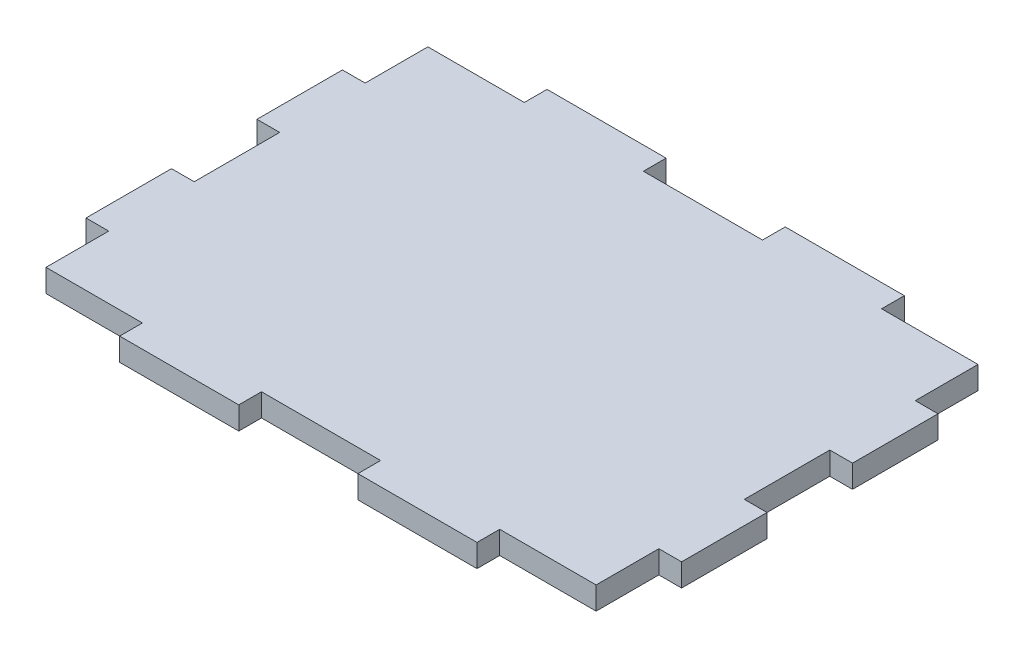
ISO-10303-21;
HEADER;
FILE_DESCRIPTION(('STEP AP214'),'2;1');
FILE_NAME('part.step','',(''),(''),'','','');
FILE_SCHEMA(('AUTOMOTIVE_DESIGN { 1 0 10303 214 1 1 1 1 }'));
ENDSEC;
DATA;
#1=APPLICATION_CONTEXT('core data for automotive mechanical design processes');
#2=APPLICATION_PROTOCOL_DEFINITION('international standard','automotive_design',2000,#1);
#3=PRODUCT_CONTEXT('',#1,'mechanical');
#4=PRODUCT('Part','Part','',(#3));
#5=PRODUCT_RELATED_PRODUCT_CATEGORY('part','',(#4));
#6=PRODUCT_DEFINITION_FORMATION('','',#4);
#7=PRODUCT_DEFINITION_CONTEXT('part definition',#1,'design');
#8=PRODUCT_DEFINITION('design','',#6,#7);
#9=PRODUCT_DEFINITION_SHAPE('','',#8);
#10=(LENGTH_UNIT() NAMED_UNIT(*) SI_UNIT(.MILLI.,.METRE.));
#11=(NAMED_UNIT(*) PLANE_ANGLE_UNIT() SI_UNIT($,.RADIAN.));
#12=(NAMED_UNIT(*) SI_UNIT($,.STERADIAN.) SOLID_ANGLE_UNIT());
#13=UNCERTAINTY_MEASURE_WITH_UNIT(LENGTH_MEASURE(1.E-05),#10,'distance_accuracy_value','');
#14=(GEOMETRIC_REPRESENTATION_CONTEXT(3) GLOBAL_UNCERTAINTY_ASSIGNED_CONTEXT((#13)) GLOBAL_UNIT_ASSIGNED_CONTEXT((#10,
#11,#12)) REPRESENTATION_CONTEXT('',''));
#15=CARTESIAN_POINT('',(0.,0.,0.));
#16=DIRECTION('',(0.,0.,1.));
#17=DIRECTION('',(1.,0.,0.));
#18=AXIS2_PLACEMENT_3D('',#15,#16,#17);
#19=CARTESIAN_POINT('',(41.5925,3.175,29.845));
#20=DIRECTION('',(-1.,0.,0.));
#21=DIRECTION('',(0.,0.,1.));
#22=AXIS2_PLACEMENT_3D('',#19,#20,#21);
#23=PLANE('',#22);
#24=DIRECTION('',(0.,0.,-1.));
#25=VECTOR('',#24,1.);
#26=CARTESIAN_POINT('',(41.5925,3.175,29.845));
#27=LINE('',#26,#25);
#28=CARTESIAN_POINT('',(41.5925,3.175,17.907));
#29=VERTEX_POINT('',#28);
#30=CARTESIAN_POINT('',(41.5925,3.175,5.96899999999999));
#31=VERTEX_POINT('',#30);
#32=EDGE_CURVE('E506',#29,#31,#27,.T.);
#33=ORIENTED_EDGE('',*,*,#32,.F.);
#34=DIRECTION('',(0.,1.,0.));
#35=VECTOR('',#34,1.);
#36=CARTESIAN_POINT('',(41.5925,0.,17.907));
#37=LINE('',#36,#35);
#38=CARTESIAN_POINT('',(41.5925,0.,17.907));
#39=VERTEX_POINT('',#38);
#40=EDGE_CURVE('E330',#39,#29,#37,.T.);
#41=ORIENTED_EDGE('',*,*,#40,.F.);
#42=DIRECTION('',(0.,0.,-1.));
#43=VECTOR('',#42,1.);
#44=CARTESIAN_POINT('',(41.5925,0.,29.845));
#45=LINE('',#44,#43);
#46=CARTESIAN_POINT('',(41.5925,0.,5.96899999999999));
#47=VERTEX_POINT('',#46);
#48=EDGE_CURVE('E521',#39,#47,#45,.T.);
#49=ORIENTED_EDGE('',*,*,#48,.T.);
#50=DIRECTION('',(0.,1.,0.));
#51=VECTOR('',#50,1.);
#52=CARTESIAN_POINT('',(41.5925,0.,5.96899999999999));
#53=LINE('',#52,#51);
#54=EDGE_CURVE('E351',#47,#31,#53,.T.);
#55=ORIENTED_EDGE('',*,*,#54,.T.);
#56=EDGE_LOOP('',(#33,#41,#49,#55));
#57=FACE_BOUND('',#56,.T.);
#58=ADVANCED_FACE('F35',(#57),#23,.F.);
#59=CARTESIAN_POINT('',(-41.5925,3.175,29.845));
#60=DIRECTION('',(1.,0.,0.));
#61=DIRECTION('',(0.,0.,-1.));
#62=AXIS2_PLACEMENT_3D('',#59,#60,#61);
#63=PLANE('',#62);
#64=DIRECTION('',(0.,0.,1.));
#65=VECTOR('',#64,1.);
#66=CARTESIAN_POINT('',(-41.5925,0.,29.845));
#67=LINE('',#66,#65);
#68=CARTESIAN_POINT('',(-41.5925,0.,-17.907));
#69=VERTEX_POINT('',#68);
#70=CARTESIAN_POINT('',(-41.5925,0.,-5.96900000000001));
#71=VERTEX_POINT('',#70);
#72=EDGE_CURVE('E525',#69,#71,#67,.T.);
#73=ORIENTED_EDGE('',*,*,#72,.T.);
#74=DIRECTION('',(0.,1.,0.));
#75=VECTOR('',#74,1.);
#76=CARTESIAN_POINT('',(-41.5925,0.,-5.96900000000001));
#77=LINE('',#76,#75);
#78=CARTESIAN_POINT('',(-41.5925,3.175,-5.96900000000001));
#79=VERTEX_POINT('',#78);
#80=EDGE_CURVE('E314',#71,#79,#77,.T.);
#81=ORIENTED_EDGE('',*,*,#80,.T.);
#82=DIRECTION('',(0.,0.,1.));
#83=VECTOR('',#82,1.);
#84=CARTESIAN_POINT('',(-41.5925,3.175,29.845));
#85=LINE('',#84,#83);
#86=CARTESIAN_POINT('',(-41.5925,3.175,-17.907));
#87=VERTEX_POINT('',#86);
#88=EDGE_CURVE('E511',#87,#79,#85,.T.);
#89=ORIENTED_EDGE('',*,*,#88,.F.);
#90=DIRECTION('',(0.,1.,0.));
#91=VECTOR('',#90,1.);
#92=CARTESIAN_POINT('',(-41.5925,0.,-17.907));
#93=LINE('',#92,#91);
#94=EDGE_CURVE('E386',#69,#87,#93,.T.);
#95=ORIENTED_EDGE('',*,*,#94,.F.);
#96=EDGE_LOOP('',(#73,#81,#89,#95));
#97=FACE_BOUND('',#96,.T.);
#98=ADVANCED_FACE('F646',(#97),#63,.F.);
#99=CARTESIAN_POINT('',(-41.5925,3.175,-29.845));
#100=DIRECTION('',(0.,0.,1.));
#101=DIRECTION('',(1.,0.,0.));
#102=AXIS2_PLACEMENT_3D('',#99,#100,#101);
#103=PLANE('',#102);
#104=DIRECTION('',(-1.,0.,0.));
#105=VECTOR('',#104,1.);
#106=CARTESIAN_POINT('',(-41.5925,3.175,-29.845));
#107=LINE('',#106,#105);
#108=CARTESIAN_POINT('',(-8.31850000000001,3.175,-29.845));
#109=VERTEX_POINT('',#108);
#110=CARTESIAN_POINT('',(-24.9555,3.175,-29.845));
#111=VERTEX_POINT('',#110);
#112=EDGE_CURVE('E508',#109,#111,#107,.T.);
#113=ORIENTED_EDGE('',*,*,#112,.F.);
#114=DIRECTION('',(0.,1.,0.));
#115=VECTOR('',#114,1.);
#116=CARTESIAN_POINT('',(-8.31850000000001,0.,-29.845));
#117=LINE('',#116,#115);
#118=CARTESIAN_POINT('',(-8.31850000000001,0.,-29.845));
#119=VERTEX_POINT('',#118);
#120=EDGE_CURVE('E466',#119,#109,#117,.T.);
#121=ORIENTED_EDGE('',*,*,#120,.F.);
#122=DIRECTION('',(-1.,0.,0.));
#123=VECTOR('',#122,1.);
#124=CARTESIAN_POINT('',(-41.5925,0.,-29.845));
#125=LINE('',#124,#123);
#126=CARTESIAN_POINT('',(-24.9555,0.,-29.845));
#127=VERTEX_POINT('',#126);
#128=EDGE_CURVE('E522',#119,#127,#125,.T.);
#129=ORIENTED_EDGE('',*,*,#128,.T.);
#130=DIRECTION('',(0.,1.,0.));
#131=VECTOR('',#130,1.);
#132=CARTESIAN_POINT('',(-24.9555,0.,-29.845));
#133=LINE('',#132,#131);
#134=EDGE_CURVE('E487',#127,#111,#133,.T.);
#135=ORIENTED_EDGE('',*,*,#134,.T.);
#136=EDGE_LOOP('',(#113,#121,#129,#135));
#137=FACE_BOUND('',#136,.T.);
#138=ADVANCED_FACE('F624',(#137),#103,.F.);
#139=CARTESIAN_POINT('',(-41.5925,3.175,29.845));
#140=DIRECTION('',(0.,0.,-1.));
#141=DIRECTION('',(-1.,0.,0.));
#142=AXIS2_PLACEMENT_3D('',#139,#140,#141);
#143=PLANE('',#142);
#144=DIRECTION('',(1.,0.,0.));
#145=VECTOR('',#144,1.);
#146=CARTESIAN_POINT('',(-41.5925,0.,29.845));
#147=LINE('',#146,#145);
#148=CARTESIAN_POINT('',(-24.9555,0.,29.845));
#149=VERTEX_POINT('',#148);
#150=CARTESIAN_POINT('',(-8.31850000000001,0.,29.845));
#151=VERTEX_POINT('',#150);
#152=EDGE_CURVE('E507',#149,#151,#147,.T.);
#153=ORIENTED_EDGE('',*,*,#152,.T.);
#154=DIRECTION('',(0.,1.,0.));
#155=VECTOR('',#154,1.);
#156=CARTESIAN_POINT('',(-8.31850000000001,0.,29.845));
#157=LINE('',#156,#155);
#158=CARTESIAN_POINT('',(-8.31850000000001,3.175,29.845));
#159=VERTEX_POINT('',#158);
#160=EDGE_CURVE('E417',#151,#159,#157,.T.);
#161=ORIENTED_EDGE('',*,*,#160,.T.);
#162=DIRECTION('',(1.,0.,0.));
#163=VECTOR('',#162,1.);
#164=CARTESIAN_POINT('',(-41.5925,3.175,29.845));
#165=LINE('',#164,#163);
#166=CARTESIAN_POINT('',(-24.9555,3.175,29.845));
#167=VERTEX_POINT('',#166);
#168=EDGE_CURVE('E516',#167,#159,#165,.T.);
#169=ORIENTED_EDGE('',*,*,#168,.F.);
#170=DIRECTION('',(0.,1.,0.));
#171=VECTOR('',#170,1.);
#172=CARTESIAN_POINT('',(-24.9555,0.,29.845));
#173=LINE('',#172,#171);
#174=EDGE_CURVE('E497',#149,#167,#173,.T.);
#175=ORIENTED_EDGE('',*,*,#174,.F.);
#176=EDGE_LOOP('',(#153,#161,#169,#175));
#177=FACE_BOUND('',#176,.T.);
#178=ADVANCED_FACE('F667',(#177),#143,.F.);
#179=CARTESIAN_POINT('',(41.5925,3.175,-5.96900000000001));
#180=VERTEX_POINT('',#179);
#181=CARTESIAN_POINT('',(41.5925,3.175,-17.907));
#182=VERTEX_POINT('',#181);
#183=EDGE_CURVE('E504',#180,#182,#27,.T.);
#184=ORIENTED_EDGE('',*,*,#183,.F.);
#185=DIRECTION('',(0.,1.,0.));
#186=VECTOR('',#185,1.);
#187=CARTESIAN_POINT('',(41.5925,0.,-5.96900000000001));
#188=LINE('',#187,#186);
#189=CARTESIAN_POINT('',(41.5925,0.,-5.96900000000001));
#190=VERTEX_POINT('',#189);
#191=EDGE_CURVE('E344',#190,#180,#188,.T.);
#192=ORIENTED_EDGE('',*,*,#191,.F.);
#193=CARTESIAN_POINT('',(41.5925,0.,-17.907));
#194=VERTEX_POINT('',#193);
#195=EDGE_CURVE('E490',#190,#194,#45,.T.);
#196=ORIENTED_EDGE('',*,*,#195,.T.);
#197=DIRECTION('',(0.,1.,0.));
#198=VECTOR('',#197,1.);
#199=CARTESIAN_POINT('',(41.5925,0.,-17.907));
#200=LINE('',#199,#198);
#201=EDGE_CURVE('E373',#194,#182,#200,.T.);
#202=ORIENTED_EDGE('',*,*,#201,.T.);
#203=EDGE_LOOP('',(#184,#192,#196,#202));
#204=FACE_BOUND('',#203,.T.);
#205=ADVANCED_FACE('F37',(#204),#23,.F.);
#206=CARTESIAN_POINT('',(24.9555,3.175,-29.845));
#207=VERTEX_POINT('',#206);
#208=CARTESIAN_POINT('',(8.31849999999999,3.175,-29.845));
#209=VERTEX_POINT('',#208);
#210=EDGE_CURVE('E510',#207,#209,#107,.T.);
#211=ORIENTED_EDGE('',*,*,#210,.F.);
#212=DIRECTION('',(0.,1.,0.));
#213=VECTOR('',#212,1.);
#214=CARTESIAN_POINT('',(24.9555,0.,-29.845));
#215=LINE('',#214,#213);
#216=CARTESIAN_POINT('',(24.9555,0.,-29.845));
#217=VERTEX_POINT('',#216);
#218=EDGE_CURVE('E421',#217,#207,#215,.T.);
#219=ORIENTED_EDGE('',*,*,#218,.F.);
#220=CARTESIAN_POINT('',(8.31849999999999,0.,-29.845));
#221=VERTEX_POINT('',#220);
#222=EDGE_CURVE('E524',#217,#221,#125,.T.);
#223=ORIENTED_EDGE('',*,*,#222,.T.);
#224=DIRECTION('',(0.,1.,0.));
#225=VECTOR('',#224,1.);
#226=CARTESIAN_POINT('',(8.31849999999999,0.,-29.845));
#227=LINE('',#226,#225);
#228=EDGE_CURVE('E469',#221,#209,#227,.T.);
#229=ORIENTED_EDGE('',*,*,#228,.T.);
#230=EDGE_LOOP('',(#211,#219,#223,#229));
#231=FACE_BOUND('',#230,.T.);
#232=ADVANCED_FACE('F601',(#231),#103,.F.);
#233=CARTESIAN_POINT('',(-41.5925,3.175,5.96899999999999));
#234=VERTEX_POINT('',#233);
#235=CARTESIAN_POINT('',(-41.5925,3.175,17.907));
#236=VERTEX_POINT('',#235);
#237=EDGE_CURVE('E515',#234,#236,#85,.T.);
#238=ORIENTED_EDGE('',*,*,#237,.F.);
#239=DIRECTION('',(0.,1.,0.));
#240=VECTOR('',#239,1.);
#241=CARTESIAN_POINT('',(-41.5925,0.,5.96899999999999));
#242=LINE('',#241,#240);
#243=CARTESIAN_POINT('',(-41.5925,0.,5.96899999999999));
#244=VERTEX_POINT('',#243);
#245=EDGE_CURVE('E305',#244,#234,#242,.T.);
#246=ORIENTED_EDGE('',*,*,#245,.F.);
#247=CARTESIAN_POINT('',(-41.5925,0.,17.907));
#248=VERTEX_POINT('',#247);
#249=EDGE_CURVE('E529',#244,#248,#67,.T.);
#250=ORIENTED_EDGE('',*,*,#249,.T.);
#251=DIRECTION('',(0.,1.,0.));
#252=VECTOR('',#251,1.);
#253=CARTESIAN_POINT('',(-41.5925,0.,17.907));
#254=LINE('',#253,#252);
#255=EDGE_CURVE('E276',#248,#236,#254,.T.);
#256=ORIENTED_EDGE('',*,*,#255,.T.);
#257=EDGE_LOOP('',(#238,#246,#250,#256));
#258=FACE_BOUND('',#257,.T.);
#259=ADVANCED_FACE('F610',(#258),#63,.F.);
#260=CARTESIAN_POINT('',(8.31849999999999,3.175,29.845));
#261=VERTEX_POINT('',#260);
#262=CARTESIAN_POINT('',(24.9555,3.175,29.845));
#263=VERTEX_POINT('',#262);
#264=EDGE_CURVE('E514',#261,#263,#165,.T.);
#265=ORIENTED_EDGE('',*,*,#264,.F.);
#266=DIRECTION('',(0.,1.,0.));
#267=VECTOR('',#266,1.);
#268=CARTESIAN_POINT('',(8.31849999999999,0.,29.845));
#269=LINE('',#268,#267);
#270=CARTESIAN_POINT('',(8.31849999999999,0.,29.845));
#271=VERTEX_POINT('',#270);
#272=EDGE_CURVE('E431',#271,#261,#269,.T.);
#273=ORIENTED_EDGE('',*,*,#272,.F.);
#274=CARTESIAN_POINT('',(24.9555,0.,29.845));
#275=VERTEX_POINT('',#274);
#276=EDGE_CURVE('E528',#271,#275,#147,.T.);
#277=ORIENTED_EDGE('',*,*,#276,.T.);
#278=DIRECTION('',(0.,1.,0.));
#279=VECTOR('',#278,1.);
#280=CARTESIAN_POINT('',(24.9555,0.,29.845));
#281=LINE('',#280,#279);
#282=EDGE_CURVE('E398',#275,#263,#281,.T.);
#283=ORIENTED_EDGE('',*,*,#282,.T.);
#284=EDGE_LOOP('',(#265,#273,#277,#283));
#285=FACE_BOUND('',#284,.T.);
#286=ADVANCED_FACE('F557',(#285),#143,.F.);
#287=CARTESIAN_POINT('',(0.,3.175,0.));
#288=DIRECTION('',(0.,-1.,0.));
#289=DIRECTION('',(0.,0.,-1.));
#290=AXIS2_PLACEMENT_3D('',#287,#288,#289);
#291=PLANE('',#290);
#292=ORIENTED_EDGE('',*,*,#88,.T.);
#293=DIRECTION('',(-1.,0.,0.));
#294=VECTOR('',#293,1.);
#295=CARTESIAN_POINT('',(-41.5925,3.175,-5.96900000000001));
#296=LINE('',#295,#294);
#297=CARTESIAN_POINT('',(-38.4175,3.175,-5.96900000000001));
#298=VERTEX_POINT('',#297);
#299=EDGE_CURVE('E301',#298,#79,#296,.T.);
#300=ORIENTED_EDGE('',*,*,#299,.F.);
#301=DIRECTION('',(0.,0.,-1.));
#302=VECTOR('',#301,1.);
#303=CARTESIAN_POINT('',(-38.4175,3.175,-5.96900000000001));
#304=LINE('',#303,#302);
#305=CARTESIAN_POINT('',(-38.4175,3.175,5.96899999999999));
#306=VERTEX_POINT('',#305);
#307=EDGE_CURVE('E309',#306,#298,#304,.T.);
#308=ORIENTED_EDGE('',*,*,#307,.F.);
#309=DIRECTION('',(1.,0.,0.));
#310=VECTOR('',#309,1.);
#311=CARTESIAN_POINT('',(-41.5925,3.175,5.96899999999999));
#312=LINE('',#311,#310);
#313=EDGE_CURVE('E306',#234,#306,#312,.T.);
#314=ORIENTED_EDGE('',*,*,#313,.F.);
#315=ORIENTED_EDGE('',*,*,#237,.T.);
#316=DIRECTION('',(-1.,0.,0.));
#317=VECTOR('',#316,1.);
#318=CARTESIAN_POINT('',(-41.5925,3.175,17.907));
#319=LINE('',#318,#317);
#320=CARTESIAN_POINT('',(-38.4175,3.175,17.907));
#321=VERTEX_POINT('',#320);
#322=EDGE_CURVE('E291',#321,#236,#319,.T.);
#323=ORIENTED_EDGE('',*,*,#322,.F.);
#324=DIRECTION('',(0.,0.,-1.));
#325=VECTOR('',#324,1.);
#326=CARTESIAN_POINT('',(-38.4175,3.175,17.907));
#327=LINE('',#326,#325);
#328=CARTESIAN_POINT('',(-38.4175,3.175,26.67));
#329=VERTEX_POINT('',#328);
#330=EDGE_CURVE('E273',#329,#321,#327,.T.);
#331=ORIENTED_EDGE('',*,*,#330,.F.);
#332=DIRECTION('',(-1.,0.,0.));
#333=VECTOR('',#332,1.);
#334=CARTESIAN_POINT('',(-41.5925,3.175,26.67));
#335=LINE('',#334,#333);
#336=CARTESIAN_POINT('',(-24.9555,3.175,26.67));
#337=VERTEX_POINT('',#336);
#338=EDGE_CURVE('E495',#337,#329,#335,.T.);
#339=ORIENTED_EDGE('',*,*,#338,.F.);
#340=DIRECTION('',(0.,0.,-1.));
#341=VECTOR('',#340,1.);
#342=CARTESIAN_POINT('',(-24.9555,3.175,29.845));
#343=LINE('',#342,#341);
#344=EDGE_CURVE('E468',#167,#337,#343,.T.);
#345=ORIENTED_EDGE('',*,*,#344,.F.);
#346=ORIENTED_EDGE('',*,*,#168,.T.);
#347=DIRECTION('',(0.,0.,1.));
#348=VECTOR('',#347,1.);
#349=CARTESIAN_POINT('',(-8.31850000000001,3.175,29.845));
#350=LINE('',#349,#348);
#351=CARTESIAN_POINT('',(-8.31850000000001,3.175,26.67));
#352=VERTEX_POINT('',#351);
#353=EDGE_CURVE('E418',#352,#159,#350,.T.);
#354=ORIENTED_EDGE('',*,*,#353,.F.);
#355=DIRECTION('',(-1.,0.,0.));
#356=VECTOR('',#355,1.);
#357=CARTESIAN_POINT('',(-8.31850000000001,3.175,26.67));
#358=LINE('',#357,#356);
#359=CARTESIAN_POINT('',(8.31849999999999,3.175,26.67));
#360=VERTEX_POINT('',#359);
#361=EDGE_CURVE('E411',#360,#352,#358,.T.);
#362=ORIENTED_EDGE('',*,*,#361,.F.);
#363=DIRECTION('',(0.,0.,-1.));
#364=VECTOR('',#363,1.);
#365=CARTESIAN_POINT('',(8.31849999999999,3.175,29.845));
#366=LINE('',#365,#364);
#367=EDGE_CURVE('E420',#261,#360,#366,.T.);
#368=ORIENTED_EDGE('',*,*,#367,.F.);
#369=ORIENTED_EDGE('',*,*,#264,.T.);
#370=DIRECTION('',(0.,0.,1.));
#371=VECTOR('',#370,1.);
#372=CARTESIAN_POINT('',(24.9555,3.175,29.845));
#373=LINE('',#372,#371);
#374=CARTESIAN_POINT('',(24.9555,3.175,26.67));
#375=VERTEX_POINT('',#374);
#376=EDGE_CURVE('E376',#375,#263,#373,.T.);
#377=ORIENTED_EDGE('',*,*,#376,.F.);
#378=DIRECTION('',(-1.,0.,0.));
#379=VECTOR('',#378,1.);
#380=CARTESIAN_POINT('',(24.9555,3.175,26.67));
#381=LINE('',#380,#379);
#382=CARTESIAN_POINT('',(38.4175,3.175,26.67));
#383=VERTEX_POINT('',#382);
#384=EDGE_CURVE('E396',#383,#375,#381,.T.);
#385=ORIENTED_EDGE('',*,*,#384,.F.);
#386=DIRECTION('',(0.,0.,1.));
#387=VECTOR('',#386,1.);
#388=CARTESIAN_POINT('',(38.4175,3.175,17.907));
#389=LINE('',#388,#387);
#390=CARTESIAN_POINT('',(38.4175,3.175,17.907));
#391=VERTEX_POINT('',#390);
#392=EDGE_CURVE('E327',#391,#383,#389,.T.);
#393=ORIENTED_EDGE('',*,*,#392,.F.);
#394=DIRECTION('',(-1.,0.,0.));
#395=VECTOR('',#394,1.);
#396=CARTESIAN_POINT('',(41.5925,3.175,17.907));
#397=LINE('',#396,#395);
#398=EDGE_CURVE('E296',#29,#391,#397,.T.);
#399=ORIENTED_EDGE('',*,*,#398,.F.);
#400=ORIENTED_EDGE('',*,*,#32,.T.);
#401=DIRECTION('',(1.,0.,0.));
#402=VECTOR('',#401,1.);
#403=CARTESIAN_POINT('',(41.5925,3.175,5.96899999999999));
#404=LINE('',#403,#402);
#405=CARTESIAN_POINT('',(38.4175,3.175,5.96899999999999));
#406=VERTEX_POINT('',#405);
#407=EDGE_CURVE('E339',#406,#31,#404,.T.);
#408=ORIENTED_EDGE('',*,*,#407,.F.);
#409=DIRECTION('',(0.,0.,1.));
#410=VECTOR('',#409,1.);
#411=CARTESIAN_POINT('',(38.4175,3.175,-5.96900000000001));
#412=LINE('',#411,#410);
#413=CARTESIAN_POINT('',(38.4175,3.175,-5.96900000000001));
#414=VERTEX_POINT('',#413);
#415=EDGE_CURVE('E347',#414,#406,#412,.T.);
#416=ORIENTED_EDGE('',*,*,#415,.F.);
#417=DIRECTION('',(-1.,0.,0.));
#418=VECTOR('',#417,1.);
#419=CARTESIAN_POINT('',(41.5925,3.175,-5.96900000000001));
#420=LINE('',#419,#418);
#421=EDGE_CURVE('E317',#180,#414,#420,.T.);
#422=ORIENTED_EDGE('',*,*,#421,.F.);
#423=ORIENTED_EDGE('',*,*,#183,.T.);
#424=DIRECTION('',(1.,0.,0.));
#425=VECTOR('',#424,1.);
#426=CARTESIAN_POINT('',(41.5925,3.175,-17.907));
#427=LINE('',#426,#425);
#428=CARTESIAN_POINT('',(38.4175,3.175,-17.907));
#429=VERTEX_POINT('',#428);
#430=EDGE_CURVE('E364',#429,#182,#427,.T.);
#431=ORIENTED_EDGE('',*,*,#430,.F.);
#432=DIRECTION('',(0.,0.,1.));
#433=VECTOR('',#432,1.);
#434=CARTESIAN_POINT('',(38.4175,3.175,-29.845));
#435=LINE('',#434,#433);
#436=CARTESIAN_POINT('',(38.4175,3.175,-26.67));
#437=VERTEX_POINT('',#436);
#438=EDGE_CURVE('E368',#437,#429,#435,.T.);
#439=ORIENTED_EDGE('',*,*,#438,.F.);
#440=DIRECTION('',(1.,0.,0.));
#441=VECTOR('',#440,1.);
#442=CARTESIAN_POINT('',(24.9555,3.175,-26.67));
#443=LINE('',#442,#441);
#444=CARTESIAN_POINT('',(24.9555,3.175,-26.67));
#445=VERTEX_POINT('',#444);
#446=EDGE_CURVE('E439',#445,#437,#443,.T.);
#447=ORIENTED_EDGE('',*,*,#446,.F.);
#448=DIRECTION('',(0.,0.,1.));
#449=VECTOR('',#448,1.);
#450=CARTESIAN_POINT('',(24.9555,3.175,-29.845));
#451=LINE('',#450,#449);
#452=EDGE_CURVE('E404',#207,#445,#451,.T.);
#453=ORIENTED_EDGE('',*,*,#452,.F.);
#454=ORIENTED_EDGE('',*,*,#210,.T.);
#455=DIRECTION('',(0.,0.,-1.));
#456=VECTOR('',#455,1.);
#457=CARTESIAN_POINT('',(8.31849999999999,3.175,-29.845));
#458=LINE('',#457,#456);
#459=CARTESIAN_POINT('',(8.31849999999999,3.175,-26.67));
#460=VERTEX_POINT('',#459);
#461=EDGE_CURVE('E453',#460,#209,#458,.T.);
#462=ORIENTED_EDGE('',*,*,#461,.F.);
#463=DIRECTION('',(1.,0.,0.));
#464=VECTOR('',#463,1.);
#465=CARTESIAN_POINT('',(-8.31850000000001,3.175,-26.67));
#466=LINE('',#465,#464);
#467=CARTESIAN_POINT('',(-8.31850000000001,3.175,-26.67));
#468=VERTEX_POINT('',#467);
#469=EDGE_CURVE('E462',#468,#460,#466,.T.);
#470=ORIENTED_EDGE('',*,*,#469,.F.);
#471=DIRECTION('',(0.,0.,1.));
#472=VECTOR('',#471,1.);
#473=CARTESIAN_POINT('',(-8.31850000000001,3.175,-29.845));
#474=LINE('',#473,#472);
#475=EDGE_CURVE('E428',#109,#468,#474,.T.);
#476=ORIENTED_EDGE('',*,*,#475,.F.);
#477=ORIENTED_EDGE('',*,*,#112,.T.);
#478=DIRECTION('',(0.,0.,-1.));
#479=VECTOR('',#478,1.);
#480=CARTESIAN_POINT('',(-24.9555,3.175,-29.845));
#481=LINE('',#480,#479);
#482=CARTESIAN_POINT('',(-24.9555,3.175,-26.67));
#483=VERTEX_POINT('',#482);
#484=EDGE_CURVE('E478',#483,#111,#481,.T.);
#485=ORIENTED_EDGE('',*,*,#484,.F.);
#486=DIRECTION('',(1.,0.,0.));
#487=VECTOR('',#486,1.);
#488=CARTESIAN_POINT('',(-41.5925,3.175,-26.67));
#489=LINE('',#488,#487);
#490=CARTESIAN_POINT('',(-38.4175,3.175,-26.67));
#491=VERTEX_POINT('',#490);
#492=EDGE_CURVE('E482',#491,#483,#489,.T.);
#493=ORIENTED_EDGE('',*,*,#492,.F.);
#494=DIRECTION('',(0.,0.,-1.));
#495=VECTOR('',#494,1.);
#496=CARTESIAN_POINT('',(-38.4175,3.175,-29.845));
#497=LINE('',#496,#495);
#498=CARTESIAN_POINT('',(-38.4175,3.175,-17.907));
#499=VERTEX_POINT('',#498);
#500=EDGE_CURVE('E383',#499,#491,#497,.T.);
#501=ORIENTED_EDGE('',*,*,#500,.F.);
#502=DIRECTION('',(1.,0.,0.));
#503=VECTOR('',#502,1.);
#504=CARTESIAN_POINT('',(-41.5925,3.175,-17.907));
#505=LINE('',#504,#503);
#506=EDGE_CURVE('E354',#87,#499,#505,.T.);
#507=ORIENTED_EDGE('',*,*,#506,.F.);
#508=EDGE_LOOP('',(#292,#300,#308,#314,#315,#323,#331,#339,#345,#346,#354,#362,#368,#369,#377,
#385,#393,#399,#400,#408,#416,#422,#423,#431,#439,#447,#453,#454,#462,#470,#476,#477,#485,#493,
#501,#507));
#509=FACE_BOUND('',#508,.T.);
#510=ADVANCED_FACE('F547',(#509),#291,.F.);
#511=CARTESIAN_POINT('',(0.,0.,0.));
#512=DIRECTION('',(0.,-1.,0.));
#513=DIRECTION('',(0.,0.,-1.));
#514=AXIS2_PLACEMENT_3D('',#511,#512,#513);
#515=PLANE('',#514);
#516=DIRECTION('',(-1.,0.,0.));
#517=VECTOR('',#516,1.);
#518=CARTESIAN_POINT('',(-41.5925,0.,-5.96900000000001));
#519=LINE('',#518,#517);
#520=CARTESIAN_POINT('',(-38.4175,0.,-5.96900000000001));
#521=VERTEX_POINT('',#520);
#522=EDGE_CURVE('E303',#521,#71,#519,.T.);
#523=ORIENTED_EDGE('',*,*,#522,.T.);
#524=ORIENTED_EDGE('',*,*,#72,.F.);
#525=DIRECTION('',(1.,0.,0.));
#526=VECTOR('',#525,1.);
#527=CARTESIAN_POINT('',(-41.5925,0.,-17.907));
#528=LINE('',#527,#526);
#529=CARTESIAN_POINT('',(-38.4175,0.,-17.907));
#530=VERTEX_POINT('',#529);
#531=EDGE_CURVE('E379',#69,#530,#528,.T.);
#532=ORIENTED_EDGE('',*,*,#531,.T.);
#533=DIRECTION('',(0.,0.,-1.));
#534=VECTOR('',#533,1.);
#535=CARTESIAN_POINT('',(-38.4175,0.,-29.845));
#536=LINE('',#535,#534);
#537=CARTESIAN_POINT('',(-38.4175,0.,-26.67));
#538=VERTEX_POINT('',#537);
#539=EDGE_CURVE('E382',#530,#538,#536,.T.);
#540=ORIENTED_EDGE('',*,*,#539,.T.);
#541=DIRECTION('',(1.,0.,0.));
#542=VECTOR('',#541,1.);
#543=CARTESIAN_POINT('',(-41.5925,0.,-26.67));
#544=LINE('',#543,#542);
#545=CARTESIAN_POINT('',(-24.9555,0.,-26.67));
#546=VERTEX_POINT('',#545);
#547=EDGE_CURVE('E475',#538,#546,#544,.T.);
#548=ORIENTED_EDGE('',*,*,#547,.T.);
#549=DIRECTION('',(0.,0.,-1.));
#550=VECTOR('',#549,1.);
#551=CARTESIAN_POINT('',(-24.9555,0.,-29.845));
#552=LINE('',#551,#550);
#553=EDGE_CURVE('E477',#546,#127,#552,.T.);
#554=ORIENTED_EDGE('',*,*,#553,.T.);
#555=ORIENTED_EDGE('',*,*,#128,.F.);
#556=DIRECTION('',(0.,0.,1.));
#557=VECTOR('',#556,1.);
#558=CARTESIAN_POINT('',(-8.31850000000001,0.,-29.845));
#559=LINE('',#558,#557);
#560=CARTESIAN_POINT('',(-8.31850000000001,0.,-26.67));
#561=VERTEX_POINT('',#560);
#562=EDGE_CURVE('E449',#119,#561,#559,.T.);
#563=ORIENTED_EDGE('',*,*,#562,.T.);
#564=DIRECTION('',(1.,0.,0.));
#565=VECTOR('',#564,1.);
#566=CARTESIAN_POINT('',(-8.31850000000001,0.,-26.67));
#567=LINE('',#566,#565);
#568=CARTESIAN_POINT('',(8.31849999999999,0.,-26.67));
#569=VERTEX_POINT('',#568);
#570=EDGE_CURVE('E452',#561,#569,#567,.T.);
#571=ORIENTED_EDGE('',*,*,#570,.T.);
#572=DIRECTION('',(0.,0.,-1.));
#573=VECTOR('',#572,1.);
#574=CARTESIAN_POINT('',(8.31849999999999,0.,-29.845));
#575=LINE('',#574,#573);
#576=EDGE_CURVE('E456',#569,#221,#575,.T.);
#577=ORIENTED_EDGE('',*,*,#576,.T.);
#578=ORIENTED_EDGE('',*,*,#222,.F.);
#579=DIRECTION('',(0.,0.,1.));
#580=VECTOR('',#579,1.);
#581=CARTESIAN_POINT('',(24.9555,0.,-29.845));
#582=LINE('',#581,#580);
#583=CARTESIAN_POINT('',(24.9555,0.,-26.67));
#584=VERTEX_POINT('',#583);
#585=EDGE_CURVE('E435',#217,#584,#582,.T.);
#586=ORIENTED_EDGE('',*,*,#585,.T.);
#587=DIRECTION('',(1.,0.,0.));
#588=VECTOR('',#587,1.);
#589=CARTESIAN_POINT('',(24.9555,0.,-26.67));
#590=LINE('',#589,#588);
#591=CARTESIAN_POINT('',(38.4175,0.,-26.67));
#592=VERTEX_POINT('',#591);
#593=EDGE_CURVE('E438',#584,#592,#590,.T.);
#594=ORIENTED_EDGE('',*,*,#593,.T.);
#595=DIRECTION('',(0.,0.,1.));
#596=VECTOR('',#595,1.);
#597=CARTESIAN_POINT('',(38.4175,0.,-29.845));
#598=LINE('',#597,#596);
#599=CARTESIAN_POINT('',(38.4175,0.,-17.907));
#600=VERTEX_POINT('',#599);
#601=EDGE_CURVE('E360',#592,#600,#598,.T.);
#602=ORIENTED_EDGE('',*,*,#601,.T.);
#603=DIRECTION('',(1.,0.,0.));
#604=VECTOR('',#603,1.);
#605=CARTESIAN_POINT('',(41.5925,0.,-17.907));
#606=LINE('',#605,#604);
#607=EDGE_CURVE('E363',#600,#194,#606,.T.);
#608=ORIENTED_EDGE('',*,*,#607,.T.);
#609=ORIENTED_EDGE('',*,*,#195,.F.);
#610=DIRECTION('',(-1.,0.,0.));
#611=VECTOR('',#610,1.);
#612=CARTESIAN_POINT('',(41.5925,0.,-5.96900000000001));
#613=LINE('',#612,#611);
#614=CARTESIAN_POINT('',(38.4175,0.,-5.96900000000001));
#615=VERTEX_POINT('',#614);
#616=EDGE_CURVE('E336',#190,#615,#613,.T.);
#617=ORIENTED_EDGE('',*,*,#616,.T.);
#618=DIRECTION('',(0.,0.,1.));
#619=VECTOR('',#618,1.);
#620=CARTESIAN_POINT('',(38.4175,0.,-5.96900000000001));
#621=LINE('',#620,#619);
#622=CARTESIAN_POINT('',(38.4175,0.,5.96899999999999));
#623=VERTEX_POINT('',#622);
#624=EDGE_CURVE('E58',#615,#623,#621,.T.);
#625=ORIENTED_EDGE('',*,*,#624,.T.);
#626=DIRECTION('',(1.,0.,0.));
#627=VECTOR('',#626,1.);
#628=CARTESIAN_POINT('',(41.5925,0.,5.96899999999999));
#629=LINE('',#628,#627);
#630=EDGE_CURVE('E341',#623,#47,#629,.T.);
#631=ORIENTED_EDGE('',*,*,#630,.T.);
#632=ORIENTED_EDGE('',*,*,#48,.F.);
#633=DIRECTION('',(-1.,0.,0.));
#634=VECTOR('',#633,1.);
#635=CARTESIAN_POINT('',(41.5925,0.,17.907));
#636=LINE('',#635,#634);
#637=CARTESIAN_POINT('',(38.4175,0.,17.907));
#638=VERTEX_POINT('',#637);
#639=EDGE_CURVE('E323',#39,#638,#636,.T.);
#640=ORIENTED_EDGE('',*,*,#639,.T.);
#641=DIRECTION('',(0.,0.,1.));
#642=VECTOR('',#641,1.);
#643=CARTESIAN_POINT('',(38.4175,0.,17.907));
#644=LINE('',#643,#642);
#645=CARTESIAN_POINT('',(38.4175,0.,26.67));
#646=VERTEX_POINT('',#645);
#647=EDGE_CURVE('E326',#638,#646,#644,.T.);
#648=ORIENTED_EDGE('',*,*,#647,.T.);
#649=DIRECTION('',(-1.,0.,0.));
#650=VECTOR('',#649,1.);
#651=CARTESIAN_POINT('',(24.9555,0.,26.67));
#652=LINE('',#651,#650);
#653=CARTESIAN_POINT('',(24.9555,0.,26.67));
#654=VERTEX_POINT('',#653);
#655=EDGE_CURVE('E395',#646,#654,#652,.T.);
#656=ORIENTED_EDGE('',*,*,#655,.T.);
#657=DIRECTION('',(0.,0.,1.));
#658=VECTOR('',#657,1.);
#659=CARTESIAN_POINT('',(24.9555,0.,29.845));
#660=LINE('',#659,#658);
#661=EDGE_CURVE('E392',#654,#275,#660,.T.);
#662=ORIENTED_EDGE('',*,*,#661,.T.);
#663=ORIENTED_EDGE('',*,*,#276,.F.);
#664=DIRECTION('',(0.,0.,-1.));
#665=VECTOR('',#664,1.);
#666=CARTESIAN_POINT('',(8.31849999999999,0.,29.845));
#667=LINE('',#666,#665);
#668=CARTESIAN_POINT('',(8.31849999999999,0.,26.67));
#669=VERTEX_POINT('',#668);
#670=EDGE_CURVE('E410',#271,#669,#667,.T.);
#671=ORIENTED_EDGE('',*,*,#670,.T.);
#672=DIRECTION('',(-1.,0.,0.));
#673=VECTOR('',#672,1.);
#674=CARTESIAN_POINT('',(-8.31850000000001,0.,26.67));
#675=LINE('',#674,#673);
#676=CARTESIAN_POINT('',(-8.31850000000001,0.,26.67));
#677=VERTEX_POINT('',#676);
#678=EDGE_CURVE('E414',#669,#677,#675,.T.);
#679=ORIENTED_EDGE('',*,*,#678,.T.);
#680=DIRECTION('',(0.,0.,1.));
#681=VECTOR('',#680,1.);
#682=CARTESIAN_POINT('',(-8.31850000000001,0.,29.845));
#683=LINE('',#682,#681);
#684=EDGE_CURVE('E407',#677,#151,#683,.T.);
#685=ORIENTED_EDGE('',*,*,#684,.T.);
#686=ORIENTED_EDGE('',*,*,#152,.F.);
#687=DIRECTION('',(0.,0.,-1.));
#688=VECTOR('',#687,1.);
#689=CARTESIAN_POINT('',(-24.9555,0.,29.845));
#690=LINE('',#689,#688);
#691=CARTESIAN_POINT('',(-24.9555,0.,26.67));
#692=VERTEX_POINT('',#691);
#693=EDGE_CURVE('E493',#149,#692,#690,.T.);
#694=ORIENTED_EDGE('',*,*,#693,.T.);
#695=DIRECTION('',(-1.,0.,0.));
#696=VECTOR('',#695,1.);
#697=CARTESIAN_POINT('',(-41.5925,0.,26.67));
#698=LINE('',#697,#696);
#699=CARTESIAN_POINT('',(-38.4175,0.,26.67));
#700=VERTEX_POINT('',#699);
#701=EDGE_CURVE('E290',#692,#700,#698,.T.);
#702=ORIENTED_EDGE('',*,*,#701,.T.);
#703=DIRECTION('',(0.,0.,-1.));
#704=VECTOR('',#703,1.);
#705=CARTESIAN_POINT('',(-38.4175,0.,17.907));
#706=LINE('',#705,#704);
#707=CARTESIAN_POINT('',(-38.4175,0.,17.907));
#708=VERTEX_POINT('',#707);
#709=EDGE_CURVE('E271',#700,#708,#706,.T.);
#710=ORIENTED_EDGE('',*,*,#709,.T.);
#711=DIRECTION('',(-1.,0.,0.));
#712=VECTOR('',#711,1.);
#713=CARTESIAN_POINT('',(-41.5925,0.,17.907));
#714=LINE('',#713,#712);
#715=EDGE_CURVE('E277',#708,#248,#714,.T.);
#716=ORIENTED_EDGE('',*,*,#715,.T.);
#717=ORIENTED_EDGE('',*,*,#249,.F.);
#718=DIRECTION('',(1.,0.,0.));
#719=VECTOR('',#718,1.);
#720=CARTESIAN_POINT('',(-41.5925,0.,5.96899999999999));
#721=LINE('',#720,#719);
#722=CARTESIAN_POINT('',(-38.4175,0.,5.96899999999999));
#723=VERTEX_POINT('',#722);
#724=EDGE_CURVE('E298',#244,#723,#721,.T.);
#725=ORIENTED_EDGE('',*,*,#724,.T.);
#726=DIRECTION('',(0.,0.,-1.));
#727=VECTOR('',#726,1.);
#728=CARTESIAN_POINT('',(-38.4175,0.,-5.96900000000001));
#729=LINE('',#728,#727);
#730=EDGE_CURVE('E50',#723,#521,#729,.T.);
#731=ORIENTED_EDGE('',*,*,#730,.T.);
#732=EDGE_LOOP('',(#523,#524,#532,#540,#548,#554,#555,#563,#571,#577,#578,#586,#594,#602,#608,
#609,#617,#625,#631,#632,#640,#648,#656,#662,#663,#671,#679,#685,#686,#694,#702,#710,#716,#717,
#725,#731));
#733=FACE_BOUND('',#732,.T.);
#734=ADVANCED_FACE('F288',(#733),#515,.T.);
#735=CARTESIAN_POINT('',(-41.5925,0.,26.67));
#736=DIRECTION('',(0.,0.,-1.));
#737=DIRECTION('',(-1.,0.,0.));
#738=AXIS2_PLACEMENT_3D('',#735,#736,#737);
#739=PLANE('',#738);
#740=ORIENTED_EDGE('',*,*,#338,.T.);
#741=DIRECTION('',(0.,-1.,0.));
#742=VECTOR('',#741,1.);
#743=CARTESIAN_POINT('',(-38.4175,0.,26.67));
#744=LINE('',#743,#742);
#745=EDGE_CURVE('E11',#329,#700,#744,.T.);
#746=ORIENTED_EDGE('',*,*,#745,.T.);
#747=ORIENTED_EDGE('',*,*,#701,.F.);
#748=DIRECTION('',(0.,1.,0.));
#749=VECTOR('',#748,1.);
#750=CARTESIAN_POINT('',(-24.9555,0.,26.67));
#751=LINE('',#750,#749);
#752=EDGE_CURVE('E484',#692,#337,#751,.T.);
#753=ORIENTED_EDGE('',*,*,#752,.T.);
#754=EDGE_LOOP('',(#740,#746,#747,#753));
#755=FACE_BOUND('',#754,.T.);
#756=ADVANCED_FACE('F858',(#755),#739,.F.);
#757=CARTESIAN_POINT('',(-24.9555,0.,29.845));
#758=DIRECTION('',(1.,0.,0.));
#759=DIRECTION('',(0.,0.,-1.));
#760=AXIS2_PLACEMENT_3D('',#757,#758,#759);
#761=PLANE('',#760);
#762=ORIENTED_EDGE('',*,*,#344,.T.);
#763=ORIENTED_EDGE('',*,*,#752,.F.);
#764=ORIENTED_EDGE('',*,*,#693,.F.);
#765=ORIENTED_EDGE('',*,*,#174,.T.);
#766=EDGE_LOOP('',(#762,#763,#764,#765));
#767=FACE_BOUND('',#766,.T.);
#768=ADVANCED_FACE('F850',(#767),#761,.F.);
#769=CARTESIAN_POINT('',(-24.9555,0.,-29.845));
#770=DIRECTION('',(1.,0.,0.));
#771=DIRECTION('',(0.,0.,-1.));
#772=AXIS2_PLACEMENT_3D('',#769,#770,#771);
#773=PLANE('',#772);
#774=ORIENTED_EDGE('',*,*,#484,.T.);
#775=ORIENTED_EDGE('',*,*,#134,.F.);
#776=ORIENTED_EDGE('',*,*,#553,.F.);
#777=DIRECTION('',(0.,1.,0.));
#778=VECTOR('',#777,1.);
#779=CARTESIAN_POINT('',(-24.9555,0.,-26.67));
#780=LINE('',#779,#778);
#781=EDGE_CURVE('E481',#546,#483,#780,.T.);
#782=ORIENTED_EDGE('',*,*,#781,.T.);
#783=EDGE_LOOP('',(#774,#775,#776,#782));
#784=FACE_BOUND('',#783,.T.);
#785=ADVANCED_FACE('F629',(#784),#773,.F.);
#786=CARTESIAN_POINT('',(-41.5925,0.,-26.67));
#787=DIRECTION('',(0.,0.,1.));
#788=DIRECTION('',(1.,0.,0.));
#789=AXIS2_PLACEMENT_3D('',#786,#787,#788);
#790=PLANE('',#789);
#791=ORIENTED_EDGE('',*,*,#547,.F.);
#792=DIRECTION('',(0.,1.,0.));
#793=VECTOR('',#792,1.);
#794=CARTESIAN_POINT('',(-38.4175,0.,-26.67));
#795=LINE('',#794,#793);
#796=EDGE_CURVE('E534',#538,#491,#795,.T.);
#797=ORIENTED_EDGE('',*,*,#796,.T.);
#798=ORIENTED_EDGE('',*,*,#492,.T.);
#799=ORIENTED_EDGE('',*,*,#781,.F.);
#800=EDGE_LOOP('',(#791,#797,#798,#799));
#801=FACE_BOUND('',#800,.T.);
#802=ADVANCED_FACE('F634',(#801),#790,.F.);
#803=CARTESIAN_POINT('',(-8.31850000000001,0.,-29.845));
#804=DIRECTION('',(-1.,0.,0.));
#805=DIRECTION('',(0.,0.,1.));
#806=AXIS2_PLACEMENT_3D('',#803,#804,#805);
#807=PLANE('',#806);
#808=ORIENTED_EDGE('',*,*,#475,.T.);
#809=DIRECTION('',(0.,1.,0.));
#810=VECTOR('',#809,1.);
#811=CARTESIAN_POINT('',(-8.31850000000001,0.,-26.67));
#812=LINE('',#811,#810);
#813=EDGE_CURVE('E459',#561,#468,#812,.T.);
#814=ORIENTED_EDGE('',*,*,#813,.F.);
#815=ORIENTED_EDGE('',*,*,#562,.F.);
#816=ORIENTED_EDGE('',*,*,#120,.T.);
#817=EDGE_LOOP('',(#808,#814,#815,#816));
#818=FACE_BOUND('',#817,.T.);
#819=ADVANCED_FACE('F705',(#818),#807,.F.);
#820=CARTESIAN_POINT('',(8.31849999999999,0.,-29.845));
#821=DIRECTION('',(1.,0.,0.));
#822=DIRECTION('',(0.,0.,-1.));
#823=AXIS2_PLACEMENT_3D('',#820,#821,#822);
#824=PLANE('',#823);
#825=ORIENTED_EDGE('',*,*,#461,.T.);
#826=ORIENTED_EDGE('',*,*,#228,.F.);
#827=ORIENTED_EDGE('',*,*,#576,.F.);
#828=DIRECTION('',(0.,1.,0.));
#829=VECTOR('',#828,1.);
#830=CARTESIAN_POINT('',(8.31849999999999,0.,-26.67));
#831=LINE('',#830,#829);
#832=EDGE_CURVE('E472',#569,#460,#831,.T.);
#833=ORIENTED_EDGE('',*,*,#832,.T.);
#834=EDGE_LOOP('',(#825,#826,#827,#833));
#835=FACE_BOUND('',#834,.T.);
#836=ADVANCED_FACE('F614',(#835),#824,.F.);
#837=CARTESIAN_POINT('',(-8.31850000000001,0.,-26.67));
#838=DIRECTION('',(0.,0.,1.));
#839=DIRECTION('',(1.,0.,0.));
#840=AXIS2_PLACEMENT_3D('',#837,#838,#839);
#841=PLANE('',#840);
#842=ORIENTED_EDGE('',*,*,#469,.T.);
#843=ORIENTED_EDGE('',*,*,#832,.F.);
#844=ORIENTED_EDGE('',*,*,#570,.F.);
#845=ORIENTED_EDGE('',*,*,#813,.T.);
#846=EDGE_LOOP('',(#842,#843,#844,#845));
#847=FACE_BOUND('',#846,.T.);
#848=ADVANCED_FACE('F616',(#847),#841,.F.);
#849=CARTESIAN_POINT('',(24.9555,0.,29.845));
#850=DIRECTION('',(-1.,0.,0.));
#851=DIRECTION('',(0.,0.,1.));
#852=AXIS2_PLACEMENT_3D('',#849,#850,#851);
#853=PLANE('',#852);
#854=ORIENTED_EDGE('',*,*,#376,.T.);
#855=ORIENTED_EDGE('',*,*,#282,.F.);
#856=ORIENTED_EDGE('',*,*,#661,.F.);
#857=DIRECTION('',(0.,1.,0.));
#858=VECTOR('',#857,1.);
#859=CARTESIAN_POINT('',(24.9555,0.,26.67));
#860=LINE('',#859,#858);
#861=EDGE_CURVE('E401',#654,#375,#860,.T.);
#862=ORIENTED_EDGE('',*,*,#861,.T.);
#863=EDGE_LOOP('',(#854,#855,#856,#862));
#864=FACE_BOUND('',#863,.T.);
#865=ADVANCED_FACE('F553',(#864),#853,.F.);
#866=CARTESIAN_POINT('',(24.9555,0.,26.67));
#867=DIRECTION('',(0.,0.,-1.));
#868=DIRECTION('',(-1.,0.,0.));
#869=AXIS2_PLACEMENT_3D('',#866,#867,#868);
#870=PLANE('',#869);
#871=ORIENTED_EDGE('',*,*,#655,.F.);
#872=DIRECTION('',(0.,1.,0.));
#873=VECTOR('',#872,1.);
#874=CARTESIAN_POINT('',(38.4175,0.,26.67));
#875=LINE('',#874,#873);
#876=EDGE_CURVE('E43',#646,#383,#875,.T.);
#877=ORIENTED_EDGE('',*,*,#876,.T.);
#878=ORIENTED_EDGE('',*,*,#384,.T.);
#879=ORIENTED_EDGE('',*,*,#861,.F.);
#880=EDGE_LOOP('',(#871,#877,#878,#879));
#881=FACE_BOUND('',#880,.T.);
#882=ADVANCED_FACE('F540',(#881),#870,.F.);
#883=CARTESIAN_POINT('',(24.9555,0.,-29.845));
#884=DIRECTION('',(-1.,0.,0.));
#885=DIRECTION('',(0.,0.,1.));
#886=AXIS2_PLACEMENT_3D('',#883,#884,#885);
#887=PLANE('',#886);
#888=ORIENTED_EDGE('',*,*,#452,.T.);
#889=DIRECTION('',(0.,1.,0.));
#890=VECTOR('',#889,1.);
#891=CARTESIAN_POINT('',(24.9555,0.,-26.67));
#892=LINE('',#891,#890);
#893=EDGE_CURVE('E442',#584,#445,#892,.T.);
#894=ORIENTED_EDGE('',*,*,#893,.F.);
#895=ORIENTED_EDGE('',*,*,#585,.F.);
#896=ORIENTED_EDGE('',*,*,#218,.T.);
#897=EDGE_LOOP('',(#888,#894,#895,#896));
#898=FACE_BOUND('',#897,.T.);
#899=ADVANCED_FACE('F595',(#898),#887,.F.);
#900=CARTESIAN_POINT('',(24.9555,0.,-26.67));
#901=DIRECTION('',(0.,0.,1.));
#902=DIRECTION('',(1.,0.,0.));
#903=AXIS2_PLACEMENT_3D('',#900,#901,#902);
#904=PLANE('',#903);
#905=ORIENTED_EDGE('',*,*,#446,.T.);
#906=DIRECTION('',(0.,-1.,0.));
#907=VECTOR('',#906,1.);
#908=CARTESIAN_POINT('',(38.4175,0.,-26.67));
#909=LINE('',#908,#907);
#910=EDGE_CURVE('E519',#437,#592,#909,.T.);
#911=ORIENTED_EDGE('',*,*,#910,.T.);
#912=ORIENTED_EDGE('',*,*,#593,.F.);
#913=ORIENTED_EDGE('',*,*,#893,.T.);
#914=EDGE_LOOP('',(#905,#911,#912,#913));
#915=FACE_BOUND('',#914,.T.);
#916=ADVANCED_FACE('F592',(#915),#904,.F.);
#917=CARTESIAN_POINT('',(-8.31850000000001,0.,29.845));
#918=DIRECTION('',(-1.,0.,0.));
#919=DIRECTION('',(0.,0.,1.));
#920=AXIS2_PLACEMENT_3D('',#917,#918,#919);
#921=PLANE('',#920);
#922=ORIENTED_EDGE('',*,*,#353,.T.);
#923=ORIENTED_EDGE('',*,*,#160,.F.);
#924=ORIENTED_EDGE('',*,*,#684,.F.);
#925=DIRECTION('',(0.,1.,0.));
#926=VECTOR('',#925,1.);
#927=CARTESIAN_POINT('',(-8.31850000000001,0.,26.67));
#928=LINE('',#927,#926);
#929=EDGE_CURVE('E426',#677,#352,#928,.T.);
#930=ORIENTED_EDGE('',*,*,#929,.T.);
#931=EDGE_LOOP('',(#922,#923,#924,#930));
#932=FACE_BOUND('',#931,.T.);
#933=ADVANCED_FACE('F752',(#932),#921,.F.);
#934=CARTESIAN_POINT('',(-8.31850000000001,0.,26.67));
#935=DIRECTION('',(0.,0.,-1.));
#936=DIRECTION('',(-1.,0.,0.));
#937=AXIS2_PLACEMENT_3D('',#934,#935,#936);
#938=PLANE('',#937);
#939=ORIENTED_EDGE('',*,*,#361,.T.);
#940=ORIENTED_EDGE('',*,*,#929,.F.);
#941=ORIENTED_EDGE('',*,*,#678,.F.);
#942=DIRECTION('',(0.,1.,0.));
#943=VECTOR('',#942,1.);
#944=CARTESIAN_POINT('',(8.31849999999999,0.,26.67));
#945=LINE('',#944,#943);
#946=EDGE_CURVE('E429',#669,#360,#945,.T.);
#947=ORIENTED_EDGE('',*,*,#946,.T.);
#948=EDGE_LOOP('',(#939,#940,#941,#947));
#949=FACE_BOUND('',#948,.T.);
#950=ADVANCED_FACE('F757',(#949),#938,.F.);
#951=CARTESIAN_POINT('',(8.31849999999999,0.,29.845));
#952=DIRECTION('',(1.,0.,0.));
#953=DIRECTION('',(0.,0.,-1.));
#954=AXIS2_PLACEMENT_3D('',#951,#952,#953);
#955=PLANE('',#954);
#956=ORIENTED_EDGE('',*,*,#367,.T.);
#957=ORIENTED_EDGE('',*,*,#946,.F.);
#958=ORIENTED_EDGE('',*,*,#670,.F.);
#959=ORIENTED_EDGE('',*,*,#272,.T.);
#960=EDGE_LOOP('',(#956,#957,#958,#959));
#961=FACE_BOUND('',#960,.T.);
#962=ADVANCED_FACE('F767',(#961),#955,.F.);
#963=CARTESIAN_POINT('',(38.4175,0.,-29.845));
#964=DIRECTION('',(-1.,0.,0.));
#965=DIRECTION('',(0.,0.,1.));
#966=AXIS2_PLACEMENT_3D('',#963,#964,#965);
#967=PLANE('',#966);
#968=ORIENTED_EDGE('',*,*,#438,.T.);
#969=DIRECTION('',(0.,1.,0.));
#970=VECTOR('',#969,1.);
#971=CARTESIAN_POINT('',(38.4175,0.,-17.907));
#972=LINE('',#971,#970);
#973=EDGE_CURVE('E367',#600,#429,#972,.T.);
#974=ORIENTED_EDGE('',*,*,#973,.F.);
#975=ORIENTED_EDGE('',*,*,#601,.F.);
#976=ORIENTED_EDGE('',*,*,#910,.F.);
#977=EDGE_LOOP('',(#968,#974,#975,#976));
#978=FACE_BOUND('',#977,.T.);
#979=ADVANCED_FACE('F588',(#978),#967,.F.);
#980=CARTESIAN_POINT('',(41.5925,0.,-17.907));
#981=DIRECTION('',(0.,0.,1.));
#982=DIRECTION('',(1.,0.,0.));
#983=AXIS2_PLACEMENT_3D('',#980,#981,#982);
#984=PLANE('',#983);
#985=ORIENTED_EDGE('',*,*,#430,.T.);
#986=ORIENTED_EDGE('',*,*,#201,.F.);
#987=ORIENTED_EDGE('',*,*,#607,.F.);
#988=ORIENTED_EDGE('',*,*,#973,.T.);
#989=EDGE_LOOP('',(#985,#986,#987,#988));
#990=FACE_BOUND('',#989,.T.);
#991=ADVANCED_FACE('F585',(#990),#984,.F.);
#992=CARTESIAN_POINT('',(-38.4175,0.,-29.845));
#993=DIRECTION('',(1.,0.,0.));
#994=DIRECTION('',(0.,0.,-1.));
#995=AXIS2_PLACEMENT_3D('',#992,#993,#994);
#996=PLANE('',#995);
#997=ORIENTED_EDGE('',*,*,#539,.F.);
#998=DIRECTION('',(0.,1.,0.));
#999=VECTOR('',#998,1.);
#1000=CARTESIAN_POINT('',(-38.4175,0.,-17.907));
#1001=LINE('',#1000,#999);
#1002=EDGE_CURVE('E370',#530,#499,#1001,.T.);
#1003=ORIENTED_EDGE('',*,*,#1002,.T.);
#1004=ORIENTED_EDGE('',*,*,#500,.T.);
#1005=ORIENTED_EDGE('',*,*,#796,.F.);
#1006=EDGE_LOOP('',(#997,#1003,#1004,#1005));
#1007=FACE_BOUND('',#1006,.T.);
#1008=ADVANCED_FACE('F640',(#1007),#996,.F.);
#1009=CARTESIAN_POINT('',(-41.5925,0.,-17.907));
#1010=DIRECTION('',(0.,0.,1.));
#1011=DIRECTION('',(1.,0.,0.));
#1012=AXIS2_PLACEMENT_3D('',#1009,#1010,#1011);
#1013=PLANE('',#1012);
#1014=ORIENTED_EDGE('',*,*,#506,.T.);
#1015=ORIENTED_EDGE('',*,*,#1002,.F.);
#1016=ORIENTED_EDGE('',*,*,#531,.F.);
#1017=ORIENTED_EDGE('',*,*,#94,.T.);
#1018=EDGE_LOOP('',(#1014,#1015,#1016,#1017));
#1019=FACE_BOUND('',#1018,.T.);
#1020=ADVANCED_FACE('F642',(#1019),#1013,.F.);
#1021=CARTESIAN_POINT('',(38.4175,0.,17.907));
#1022=DIRECTION('',(-1.,0.,0.));
#1023=DIRECTION('',(0.,0.,1.));
#1024=AXIS2_PLACEMENT_3D('',#1021,#1022,#1023);
#1025=PLANE('',#1024);
#1026=ORIENTED_EDGE('',*,*,#647,.F.);
#1027=DIRECTION('',(0.,1.,0.));
#1028=VECTOR('',#1027,1.);
#1029=CARTESIAN_POINT('',(38.4175,0.,17.907));
#1030=LINE('',#1029,#1028);
#1031=EDGE_CURVE('E310',#638,#391,#1030,.T.);
#1032=ORIENTED_EDGE('',*,*,#1031,.T.);
#1033=ORIENTED_EDGE('',*,*,#392,.T.);
#1034=ORIENTED_EDGE('',*,*,#876,.F.);
#1035=EDGE_LOOP('',(#1026,#1032,#1033,#1034));
#1036=FACE_BOUND('',#1035,.T.);
#1037=ADVANCED_FACE('F561',(#1036),#1025,.F.);
#1038=CARTESIAN_POINT('',(41.5925,0.,17.907));
#1039=DIRECTION('',(0.,0.,-1.));
#1040=DIRECTION('',(-1.,0.,0.));
#1041=AXIS2_PLACEMENT_3D('',#1038,#1039,#1040);
#1042=PLANE('',#1041);
#1043=ORIENTED_EDGE('',*,*,#398,.T.);
#1044=ORIENTED_EDGE('',*,*,#1031,.F.);
#1045=ORIENTED_EDGE('',*,*,#639,.F.);
#1046=ORIENTED_EDGE('',*,*,#40,.T.);
#1047=EDGE_LOOP('',(#1043,#1044,#1045,#1046));
#1048=FACE_BOUND('',#1047,.T.);
#1049=ADVANCED_FACE('F563',(#1048),#1042,.F.);
#1050=CARTESIAN_POINT('',(-38.4175,0.,17.907));
#1051=DIRECTION('',(1.,0.,0.));
#1052=DIRECTION('',(0.,0.,-1.));
#1053=AXIS2_PLACEMENT_3D('',#1050,#1051,#1052);
#1054=PLANE('',#1053);
#1055=ORIENTED_EDGE('',*,*,#330,.T.);
#1056=DIRECTION('',(0.,1.,0.));
#1057=VECTOR('',#1056,1.);
#1058=CARTESIAN_POINT('',(-38.4175,0.,17.907));
#1059=LINE('',#1058,#1057);
#1060=EDGE_CURVE('E267',#708,#321,#1059,.T.);
#1061=ORIENTED_EDGE('',*,*,#1060,.F.);
#1062=ORIENTED_EDGE('',*,*,#709,.F.);
#1063=ORIENTED_EDGE('',*,*,#745,.F.);
#1064=EDGE_LOOP('',(#1055,#1061,#1062,#1063));
#1065=FACE_BOUND('',#1064,.T.);
#1066=ADVANCED_FACE('F269',(#1065),#1054,.F.);
#1067=CARTESIAN_POINT('',(-41.5925,0.,17.907));
#1068=DIRECTION('',(0.,0.,-1.));
#1069=DIRECTION('',(-1.,0.,0.));
#1070=AXIS2_PLACEMENT_3D('',#1067,#1068,#1069);
#1071=PLANE('',#1070);
#1072=ORIENTED_EDGE('',*,*,#322,.T.);
#1073=ORIENTED_EDGE('',*,*,#255,.F.);
#1074=ORIENTED_EDGE('',*,*,#715,.F.);
#1075=ORIENTED_EDGE('',*,*,#1060,.T.);
#1076=EDGE_LOOP('',(#1072,#1073,#1074,#1075));
#1077=FACE_BOUND('',#1076,.T.);
#1078=ADVANCED_FACE('F280',(#1077),#1071,.F.);
#1079=CARTESIAN_POINT('',(41.5925,0.,5.96899999999999));
#1080=DIRECTION('',(0.,0.,1.));
#1081=DIRECTION('',(1.,0.,0.));
#1082=AXIS2_PLACEMENT_3D('',#1079,#1080,#1081);
#1083=PLANE('',#1082);
#1084=ORIENTED_EDGE('',*,*,#407,.T.);
#1085=ORIENTED_EDGE('',*,*,#54,.F.);
#1086=ORIENTED_EDGE('',*,*,#630,.F.);
#1087=DIRECTION('',(0.,1.,0.));
#1088=VECTOR('',#1087,1.);
#1089=CARTESIAN_POINT('',(38.4175,0.,5.96899999999999));
#1090=LINE('',#1089,#1088);
#1091=EDGE_CURVE('E355',#623,#406,#1090,.T.);
#1092=ORIENTED_EDGE('',*,*,#1091,.T.);
#1093=EDGE_LOOP('',(#1084,#1085,#1086,#1092));
#1094=FACE_BOUND('',#1093,.T.);
#1095=ADVANCED_FACE('F572',(#1094),#1083,.F.);
#1096=CARTESIAN_POINT('',(38.4175,0.,-5.96900000000001));
#1097=DIRECTION('',(-1.,0.,0.));
#1098=DIRECTION('',(0.,0.,1.));
#1099=AXIS2_PLACEMENT_3D('',#1096,#1097,#1098);
#1100=PLANE('',#1099);
#1101=ORIENTED_EDGE('',*,*,#415,.T.);
#1102=ORIENTED_EDGE('',*,*,#1091,.F.);
#1103=ORIENTED_EDGE('',*,*,#624,.F.);
#1104=DIRECTION('',(0.,1.,0.));
#1105=VECTOR('',#1104,1.);
#1106=CARTESIAN_POINT('',(38.4175,0.,-5.96900000000001));
#1107=LINE('',#1106,#1105);
#1108=EDGE_CURVE('E357',#615,#414,#1107,.T.);
#1109=ORIENTED_EDGE('',*,*,#1108,.T.);
#1110=EDGE_LOOP('',(#1101,#1102,#1103,#1109));
#1111=FACE_BOUND('',#1110,.T.);
#1112=ADVANCED_FACE('F891',(#1111),#1100,.F.);
#1113=CARTESIAN_POINT('',(41.5925,0.,-5.96900000000001));
#1114=DIRECTION('',(0.,0.,-1.));
#1115=DIRECTION('',(-1.,0.,0.));
#1116=AXIS2_PLACEMENT_3D('',#1113,#1114,#1115);
#1117=PLANE('',#1116);
#1118=ORIENTED_EDGE('',*,*,#421,.T.);
#1119=ORIENTED_EDGE('',*,*,#1108,.F.);
#1120=ORIENTED_EDGE('',*,*,#616,.F.);
#1121=ORIENTED_EDGE('',*,*,#191,.T.);
#1122=EDGE_LOOP('',(#1118,#1119,#1120,#1121));
#1123=FACE_BOUND('',#1122,.T.);
#1124=ADVANCED_FACE('F576',(#1123),#1117,.F.);
#1125=CARTESIAN_POINT('',(-41.5925,0.,-5.96900000000001));
#1126=DIRECTION('',(0.,0.,-1.));
#1127=DIRECTION('',(-1.,0.,0.));
#1128=AXIS2_PLACEMENT_3D('',#1125,#1126,#1127);
#1129=PLANE('',#1128);
#1130=ORIENTED_EDGE('',*,*,#299,.T.);
#1131=ORIENTED_EDGE('',*,*,#80,.F.);
#1132=ORIENTED_EDGE('',*,*,#522,.F.);
#1133=DIRECTION('',(0.,1.,0.));
#1134=VECTOR('',#1133,1.);
#1135=CARTESIAN_POINT('',(-38.4175,0.,-5.96900000000001));
#1136=LINE('',#1135,#1134);
#1137=EDGE_CURVE('E318',#521,#298,#1136,.T.);
#1138=ORIENTED_EDGE('',*,*,#1137,.T.);
#1139=EDGE_LOOP('',(#1130,#1131,#1132,#1138));
#1140=FACE_BOUND('',#1139,.T.);
#1141=ADVANCED_FACE('F649',(#1140),#1129,.F.);
#1142=CARTESIAN_POINT('',(-38.4175,0.,-5.96900000000001));
#1143=DIRECTION('',(1.,0.,0.));
#1144=DIRECTION('',(0.,0.,-1.));
#1145=AXIS2_PLACEMENT_3D('',#1142,#1143,#1144);
#1146=PLANE('',#1145);
#1147=ORIENTED_EDGE('',*,*,#307,.T.);
#1148=ORIENTED_EDGE('',*,*,#1137,.F.);
#1149=ORIENTED_EDGE('',*,*,#730,.F.);
#1150=DIRECTION('',(0.,1.,0.));
#1151=VECTOR('',#1150,1.);
#1152=CARTESIAN_POINT('',(-38.4175,0.,5.96899999999999));
#1153=LINE('',#1152,#1151);
#1154=EDGE_CURVE('E320',#723,#306,#1153,.T.);
#1155=ORIENTED_EDGE('',*,*,#1154,.T.);
#1156=EDGE_LOOP('',(#1147,#1148,#1149,#1155));
#1157=FACE_BOUND('',#1156,.T.);
#1158=ADVANCED_FACE('F651',(#1157),#1146,.F.);
#1159=CARTESIAN_POINT('',(-41.5925,0.,5.96899999999999));
#1160=DIRECTION('',(0.,0.,1.));
#1161=DIRECTION('',(1.,0.,0.));
#1162=AXIS2_PLACEMENT_3D('',#1159,#1160,#1161);
#1163=PLANE('',#1162);
#1164=ORIENTED_EDGE('',*,*,#313,.T.);
#1165=ORIENTED_EDGE('',*,*,#1154,.F.);
#1166=ORIENTED_EDGE('',*,*,#724,.F.);
#1167=ORIENTED_EDGE('',*,*,#245,.T.);
#1168=EDGE_LOOP('',(#1164,#1165,#1166,#1167));
#1169=FACE_BOUND('',#1168,.T.);
#1170=ADVANCED_FACE('F653',(#1169),#1163,.F.);
#1171=CLOSED_SHELL('',(#58,#98,#138,#178,#205,#232,#259,#286,#510,#734,#756,#768,#785,#802,#819,
#836,#848,#865,#882,#899,#916,#933,#950,#962,#979,#991,#1008,#1020,#1037,#1049,#1066,#1078,
#1095,#1112,#1124,#1141,#1158,#1170));
#1172=MANIFOLD_SOLID_BREP('B2',#1171);
#1173=ADVANCED_BREP_SHAPE_REPRESENTATION('',(#18,#1172),#14);
#1174=SHAPE_DEFINITION_REPRESENTATION(#9,#1173);
ENDSEC;
END-ISO-10303-21;
